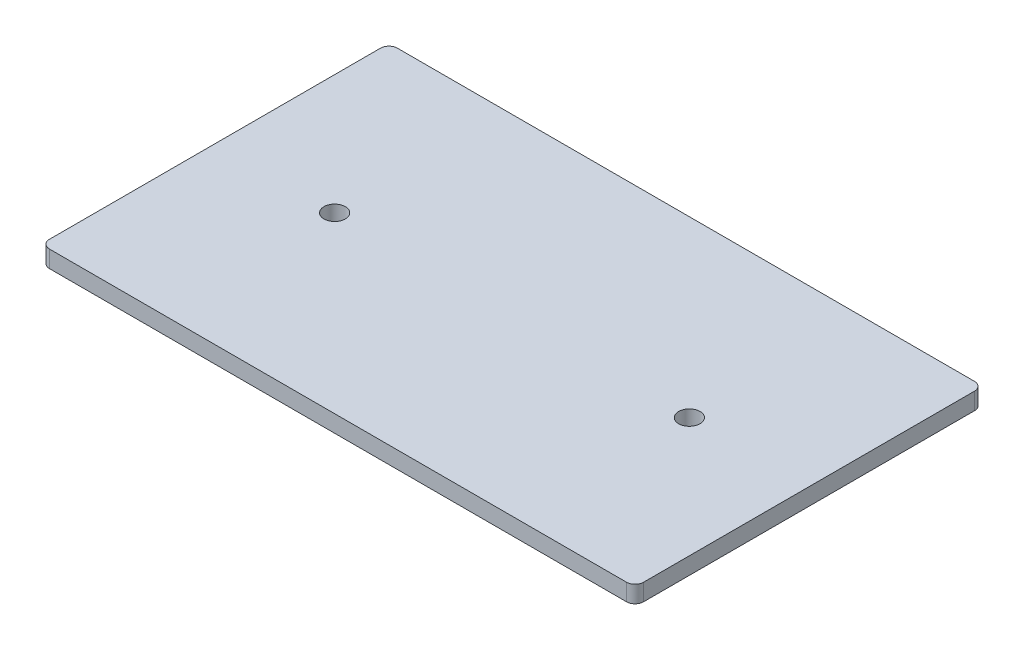
ISO-10303-21;
HEADER;
FILE_DESCRIPTION(('STEP AP214'),'2;1');
FILE_NAME('part.step','',(''),(''),'','','');
FILE_SCHEMA(('AUTOMOTIVE_DESIGN { 1 0 10303 214 1 1 1 1 }'));
ENDSEC;
DATA;
#1=APPLICATION_CONTEXT('core data for automotive mechanical design processes');
#2=APPLICATION_PROTOCOL_DEFINITION('international standard','automotive_design',2000,#1);
#3=PRODUCT_CONTEXT('',#1,'mechanical');
#4=PRODUCT('Part','Part','',(#3));
#5=PRODUCT_RELATED_PRODUCT_CATEGORY('part','',(#4));
#6=PRODUCT_DEFINITION_FORMATION('','',#4);
#7=PRODUCT_DEFINITION_CONTEXT('part definition',#1,'design');
#8=PRODUCT_DEFINITION('design','',#6,#7);
#9=PRODUCT_DEFINITION_SHAPE('','',#8);
#10=(LENGTH_UNIT() NAMED_UNIT(*) SI_UNIT(.MILLI.,.METRE.));
#11=(NAMED_UNIT(*) PLANE_ANGLE_UNIT() SI_UNIT($,.RADIAN.));
#12=(NAMED_UNIT(*) SI_UNIT($,.STERADIAN.) SOLID_ANGLE_UNIT());
#13=UNCERTAINTY_MEASURE_WITH_UNIT(LENGTH_MEASURE(1.E-05),#10,'distance_accuracy_value','');
#14=(GEOMETRIC_REPRESENTATION_CONTEXT(3) GLOBAL_UNCERTAINTY_ASSIGNED_CONTEXT((#13)) GLOBAL_UNIT_ASSIGNED_CONTEXT((#10,
#11,#12)) REPRESENTATION_CONTEXT('',''));
#15=CARTESIAN_POINT('',(0.,0.,0.));
#16=DIRECTION('',(0.,0.,1.));
#17=DIRECTION('',(1.,0.,0.));
#18=AXIS2_PLACEMENT_3D('',#15,#16,#17);
#19=CARTESIAN_POINT('',(-44.45,2.54,26.035));
#20=DIRECTION('',(1.,0.,0.));
#21=DIRECTION('',(0.,0.,-1.));
#22=AXIS2_PLACEMENT_3D('',#19,#20,#21);
#23=PLANE('',#22);
#24=DIRECTION('',(0.,0.,1.));
#25=VECTOR('',#24,1.);
#26=CARTESIAN_POINT('',(-44.45,2.54,26.035));
#27=LINE('',#26,#25);
#28=CARTESIAN_POINT('',(-44.45,2.54,-24.765));
#29=VERTEX_POINT('',#28);
#30=CARTESIAN_POINT('',(-44.45,2.54,24.765));
#31=VERTEX_POINT('',#30);
#32=EDGE_CURVE('E132',#29,#31,#27,.T.);
#33=ORIENTED_EDGE('',*,*,#32,.F.);
#34=DIRECTION('',(0.,-1.,0.));
#35=VECTOR('',#34,1.);
#36=CARTESIAN_POINT('',(-44.45,2.54,-24.765));
#37=LINE('',#36,#35);
#38=CARTESIAN_POINT('',(-44.45,0.,-24.765));
#39=VERTEX_POINT('',#38);
#40=EDGE_CURVE('E117',#29,#39,#37,.T.);
#41=ORIENTED_EDGE('',*,*,#40,.T.);
#42=DIRECTION('',(0.,0.,1.));
#43=VECTOR('',#42,1.);
#44=CARTESIAN_POINT('',(-44.45,0.,26.035));
#45=LINE('',#44,#43);
#46=CARTESIAN_POINT('',(-44.45,0.,24.765));
#47=VERTEX_POINT('',#46);
#48=EDGE_CURVE('E129',#39,#47,#45,.T.);
#49=ORIENTED_EDGE('',*,*,#48,.T.);
#50=DIRECTION('',(0.,-1.,0.));
#51=VECTOR('',#50,1.);
#52=CARTESIAN_POINT('',(-44.45,2.54,24.765));
#53=LINE('',#52,#51);
#54=EDGE_CURVE('E134',#47,#31,#53,.F.);
#55=ORIENTED_EDGE('',*,*,#54,.T.);
#56=EDGE_LOOP('',(#33,#41,#49,#55));
#57=FACE_BOUND('',#56,.T.);
#58=ADVANCED_FACE('F44',(#57),#23,.F.);
#59=CARTESIAN_POINT('',(44.45,2.54,26.035));
#60=DIRECTION('',(0.,0.,-1.));
#61=DIRECTION('',(-1.,0.,0.));
#62=AXIS2_PLACEMENT_3D('',#59,#60,#61);
#63=PLANE('',#62);
#64=DIRECTION('',(1.,0.,0.));
#65=VECTOR('',#64,1.);
#66=CARTESIAN_POINT('',(44.45,2.54,26.035));
#67=LINE('',#66,#65);
#68=CARTESIAN_POINT('',(-43.18,2.54,26.035));
#69=VERTEX_POINT('',#68);
#70=CARTESIAN_POINT('',(43.18,2.54,26.035));
#71=VERTEX_POINT('',#70);
#72=EDGE_CURVE('E184',#69,#71,#67,.T.);
#73=ORIENTED_EDGE('',*,*,#72,.F.);
#74=DIRECTION('',(0.,-1.,0.));
#75=VECTOR('',#74,1.);
#76=CARTESIAN_POINT('',(-43.18,2.54,26.035));
#77=LINE('',#76,#75);
#78=CARTESIAN_POINT('',(-43.18,0.,26.035));
#79=VERTEX_POINT('',#78);
#80=EDGE_CURVE('E11',#69,#79,#77,.T.);
#81=ORIENTED_EDGE('',*,*,#80,.T.);
#82=DIRECTION('',(1.,0.,0.));
#83=VECTOR('',#82,1.);
#84=CARTESIAN_POINT('',(44.45,0.,26.035));
#85=LINE('',#84,#83);
#86=CARTESIAN_POINT('',(43.18,0.,26.035));
#87=VERTEX_POINT('',#86);
#88=EDGE_CURVE('E139',#79,#87,#85,.T.);
#89=ORIENTED_EDGE('',*,*,#88,.T.);
#90=DIRECTION('',(0.,-1.,0.));
#91=VECTOR('',#90,1.);
#92=CARTESIAN_POINT('',(43.18,2.54,26.035));
#93=LINE('',#92,#91);
#94=EDGE_CURVE('E53',#87,#71,#93,.F.);
#95=ORIENTED_EDGE('',*,*,#94,.T.);
#96=EDGE_LOOP('',(#73,#81,#89,#95));
#97=FACE_BOUND('',#96,.T.);
#98=ADVANCED_FACE('F202',(#97),#63,.F.);
#99=CARTESIAN_POINT('',(44.45,2.54,26.035));
#100=DIRECTION('',(-1.,0.,0.));
#101=DIRECTION('',(0.,0.,1.));
#102=AXIS2_PLACEMENT_3D('',#99,#100,#101);
#103=PLANE('',#102);
#104=DIRECTION('',(0.,0.,-1.));
#105=VECTOR('',#104,1.);
#106=CARTESIAN_POINT('',(44.45,0.,26.035));
#107=LINE('',#106,#105);
#108=CARTESIAN_POINT('',(44.45,0.,24.765));
#109=VERTEX_POINT('',#108);
#110=CARTESIAN_POINT('',(44.45,0.,-24.765));
#111=VERTEX_POINT('',#110);
#112=EDGE_CURVE('E142',#109,#111,#107,.T.);
#113=ORIENTED_EDGE('',*,*,#112,.T.);
#114=DIRECTION('',(0.,-1.,0.));
#115=VECTOR('',#114,1.);
#116=CARTESIAN_POINT('',(44.45,2.54,-24.765));
#117=LINE('',#116,#115);
#118=CARTESIAN_POINT('',(44.45,2.54,-24.765));
#119=VERTEX_POINT('',#118);
#120=EDGE_CURVE('E61',#111,#119,#117,.F.);
#121=ORIENTED_EDGE('',*,*,#120,.T.);
#122=DIRECTION('',(0.,0.,-1.));
#123=VECTOR('',#122,1.);
#124=CARTESIAN_POINT('',(44.45,2.54,26.035));
#125=LINE('',#124,#123);
#126=CARTESIAN_POINT('',(44.45,2.54,24.765));
#127=VERTEX_POINT('',#126);
#128=EDGE_CURVE('E185',#127,#119,#125,.T.);
#129=ORIENTED_EDGE('',*,*,#128,.F.);
#130=DIRECTION('',(0.,-1.,0.));
#131=VECTOR('',#130,1.);
#132=CARTESIAN_POINT('',(44.45,2.54,24.765));
#133=LINE('',#132,#131);
#134=EDGE_CURVE('E167',#127,#109,#133,.T.);
#135=ORIENTED_EDGE('',*,*,#134,.T.);
#136=EDGE_LOOP('',(#113,#121,#129,#135));
#137=FACE_BOUND('',#136,.T.);
#138=ADVANCED_FACE('F196',(#137),#103,.F.);
#139=CARTESIAN_POINT('',(44.45,2.54,-26.035));
#140=DIRECTION('',(0.,0.,1.));
#141=DIRECTION('',(1.,0.,0.));
#142=AXIS2_PLACEMENT_3D('',#139,#140,#141);
#143=PLANE('',#142);
#144=DIRECTION('',(-1.,0.,0.));
#145=VECTOR('',#144,1.);
#146=CARTESIAN_POINT('',(44.45,0.,-26.035));
#147=LINE('',#146,#145);
#148=CARTESIAN_POINT('',(43.18,0.,-26.035));
#149=VERTEX_POINT('',#148);
#150=CARTESIAN_POINT('',(-43.18,0.,-26.035));
#151=VERTEX_POINT('',#150);
#152=EDGE_CURVE('E151',#149,#151,#147,.T.);
#153=ORIENTED_EDGE('',*,*,#152,.T.);
#154=DIRECTION('',(0.,-1.,0.));
#155=VECTOR('',#154,1.);
#156=CARTESIAN_POINT('',(-43.18,2.54,-26.035));
#157=LINE('',#156,#155);
#158=CARTESIAN_POINT('',(-43.18,2.54,-26.035));
#159=VERTEX_POINT('',#158);
#160=EDGE_CURVE('E118',#151,#159,#157,.F.);
#161=ORIENTED_EDGE('',*,*,#160,.T.);
#162=DIRECTION('',(-1.,0.,0.));
#163=VECTOR('',#162,1.);
#164=CARTESIAN_POINT('',(44.45,2.54,-26.035));
#165=LINE('',#164,#163);
#166=CARTESIAN_POINT('',(43.18,2.54,-26.035));
#167=VERTEX_POINT('',#166);
#168=EDGE_CURVE('E147',#167,#159,#165,.T.);
#169=ORIENTED_EDGE('',*,*,#168,.F.);
#170=DIRECTION('',(0.,-1.,0.));
#171=VECTOR('',#170,1.);
#172=CARTESIAN_POINT('',(43.18,2.54,-26.035));
#173=LINE('',#172,#171);
#174=EDGE_CURVE('E123',#167,#149,#173,.T.);
#175=ORIENTED_EDGE('',*,*,#174,.T.);
#176=EDGE_LOOP('',(#153,#161,#169,#175));
#177=FACE_BOUND('',#176,.T.);
#178=ADVANCED_FACE('F192',(#177),#143,.F.);
#179=CARTESIAN_POINT('',(0.,2.54,0.));
#180=DIRECTION('',(0.,1.,0.));
#181=DIRECTION('',(0.,0.,1.));
#182=AXIS2_PLACEMENT_3D('',#179,#180,#181);
#183=PLANE('',#182);
#184=CARTESIAN_POINT('',(-26.543,2.54,0.));
#185=DIRECTION('',(0.,1.,0.));
#186=DIRECTION('',(0.,0.,1.));
#187=AXIS2_PLACEMENT_3D('',#184,#185,#186);
#188=CIRCLE('',#187,1.6);
#189=CARTESIAN_POINT('',(-26.543,2.54,1.6));
#190=VERTEX_POINT('',#189);
#191=EDGE_CURVE('E172',#190,#190,#188,.T.);
#192=ORIENTED_EDGE('',*,*,#191,.F.);
#193=EDGE_LOOP('',(#192));
#194=FACE_BOUND('',#193,.T.);
#195=CARTESIAN_POINT('',(26.543,2.54,0.));
#196=DIRECTION('',(0.,1.,0.));
#197=DIRECTION('',(0.,0.,1.));
#198=AXIS2_PLACEMENT_3D('',#195,#196,#197);
#199=CIRCLE('',#198,1.6);
#200=CARTESIAN_POINT('',(26.543,2.54,1.6));
#201=VERTEX_POINT('',#200);
#202=EDGE_CURVE('E176',#201,#201,#199,.T.);
#203=ORIENTED_EDGE('',*,*,#202,.F.);
#204=EDGE_LOOP('',(#203));
#205=FACE_BOUND('',#204,.T.);
#206=ORIENTED_EDGE('',*,*,#168,.T.);
#207=CARTESIAN_POINT('',(-43.18,2.54,-24.765));
#208=DIRECTION('',(0.,1.,0.));
#209=DIRECTION('',(0.,0.,1.));
#210=AXIS2_PLACEMENT_3D('',#207,#208,#209);
#211=CIRCLE('',#210,1.27);
#212=EDGE_CURVE('E165',#159,#29,#211,.T.);
#213=ORIENTED_EDGE('',*,*,#212,.T.);
#214=ORIENTED_EDGE('',*,*,#32,.T.);
#215=CARTESIAN_POINT('',(-43.18,2.54,24.765));
#216=DIRECTION('',(0.,1.,0.));
#217=DIRECTION('',(0.,0.,1.));
#218=AXIS2_PLACEMENT_3D('',#215,#216,#217);
#219=CIRCLE('',#218,1.27);
#220=EDGE_CURVE('E161',#31,#69,#219,.T.);
#221=ORIENTED_EDGE('',*,*,#220,.T.);
#222=ORIENTED_EDGE('',*,*,#72,.T.);
#223=CARTESIAN_POINT('',(43.18,2.54,24.765));
#224=DIRECTION('',(0.,1.,0.));
#225=DIRECTION('',(0.,0.,1.));
#226=AXIS2_PLACEMENT_3D('',#223,#224,#225);
#227=CIRCLE('',#226,1.27);
#228=EDGE_CURVE('E68',#71,#127,#227,.T.);
#229=ORIENTED_EDGE('',*,*,#228,.T.);
#230=ORIENTED_EDGE('',*,*,#128,.T.);
#231=CARTESIAN_POINT('',(43.18,2.54,-24.765));
#232=DIRECTION('',(0.,1.,0.));
#233=DIRECTION('',(0.,0.,1.));
#234=AXIS2_PLACEMENT_3D('',#231,#232,#233);
#235=CIRCLE('',#234,1.27);
#236=EDGE_CURVE('E163',#119,#167,#235,.T.);
#237=ORIENTED_EDGE('',*,*,#236,.T.);
#238=EDGE_LOOP('',(#206,#213,#214,#221,#222,#229,#230,#237));
#239=FACE_BOUND('',#238,.T.);
#240=ADVANCED_FACE('F189',(#194,#205,#239),#183,.T.);
#241=CARTESIAN_POINT('',(0.,0.,0.));
#242=DIRECTION('',(0.,1.,0.));
#243=DIRECTION('',(0.,0.,1.));
#244=AXIS2_PLACEMENT_3D('',#241,#242,#243);
#245=PLANE('',#244);
#246=CARTESIAN_POINT('',(-26.543,0.,0.));
#247=DIRECTION('',(0.,1.,0.));
#248=DIRECTION('',(0.,0.,1.));
#249=AXIS2_PLACEMENT_3D('',#246,#247,#248);
#250=CIRCLE('',#249,1.6);
#251=CARTESIAN_POINT('',(-26.543,0.,1.6));
#252=VERTEX_POINT('',#251);
#253=EDGE_CURVE('E48',#252,#252,#250,.T.);
#254=ORIENTED_EDGE('',*,*,#253,.T.);
#255=EDGE_LOOP('',(#254));
#256=FACE_BOUND('',#255,.T.);
#257=CARTESIAN_POINT('',(26.543,0.,0.));
#258=DIRECTION('',(0.,1.,0.));
#259=DIRECTION('',(0.,0.,1.));
#260=AXIS2_PLACEMENT_3D('',#257,#258,#259);
#261=CIRCLE('',#260,1.6);
#262=CARTESIAN_POINT('',(26.543,0.,1.6));
#263=VERTEX_POINT('',#262);
#264=EDGE_CURVE('E145',#263,#263,#261,.T.);
#265=ORIENTED_EDGE('',*,*,#264,.T.);
#266=EDGE_LOOP('',(#265));
#267=FACE_BOUND('',#266,.T.);
#268=ORIENTED_EDGE('',*,*,#48,.F.);
#269=CARTESIAN_POINT('',(-43.18,0.,-24.765));
#270=DIRECTION('',(0.,1.,0.));
#271=DIRECTION('',(0.,0.,1.));
#272=AXIS2_PLACEMENT_3D('',#269,#270,#271);
#273=CIRCLE('',#272,1.27);
#274=EDGE_CURVE('E113',#39,#151,#273,.F.);
#275=ORIENTED_EDGE('',*,*,#274,.T.);
#276=ORIENTED_EDGE('',*,*,#152,.F.);
#277=CARTESIAN_POINT('',(43.18,0.,-24.765));
#278=DIRECTION('',(0.,1.,0.));
#279=DIRECTION('',(0.,0.,1.));
#280=AXIS2_PLACEMENT_3D('',#277,#278,#279);
#281=CIRCLE('',#280,1.27);
#282=EDGE_CURVE('E124',#149,#111,#281,.F.);
#283=ORIENTED_EDGE('',*,*,#282,.T.);
#284=ORIENTED_EDGE('',*,*,#112,.F.);
#285=CARTESIAN_POINT('',(43.18,0.,24.765));
#286=DIRECTION('',(0.,1.,0.));
#287=DIRECTION('',(0.,0.,1.));
#288=AXIS2_PLACEMENT_3D('',#285,#286,#287);
#289=CIRCLE('',#288,1.27);
#290=EDGE_CURVE('E133',#109,#87,#289,.F.);
#291=ORIENTED_EDGE('',*,*,#290,.T.);
#292=ORIENTED_EDGE('',*,*,#88,.F.);
#293=CARTESIAN_POINT('',(-43.18,0.,24.765));
#294=DIRECTION('',(0.,1.,0.));
#295=DIRECTION('',(0.,0.,1.));
#296=AXIS2_PLACEMENT_3D('',#293,#294,#295);
#297=CIRCLE('',#296,1.27);
#298=EDGE_CURVE('E138',#79,#47,#297,.F.);
#299=ORIENTED_EDGE('',*,*,#298,.T.);
#300=EDGE_LOOP('',(#268,#275,#276,#283,#284,#291,#292,#299));
#301=FACE_BOUND('',#300,.T.);
#302=ADVANCED_FACE('F136',(#256,#267,#301),#245,.F.);
#303=CARTESIAN_POINT('',(-43.18,2.54,-24.765));
#304=DIRECTION('',(0.,-1.,0.));
#305=DIRECTION('',(0.,0.,-1.));
#306=AXIS2_PLACEMENT_3D('',#303,#304,#305);
#307=CYLINDRICAL_SURFACE('',#306,1.27);
#308=ORIENTED_EDGE('',*,*,#212,.F.);
#309=ORIENTED_EDGE('',*,*,#160,.F.);
#310=ORIENTED_EDGE('',*,*,#274,.F.);
#311=ORIENTED_EDGE('',*,*,#40,.F.);
#312=EDGE_LOOP('',(#308,#309,#310,#311));
#313=FACE_BOUND('',#312,.T.);
#314=ADVANCED_FACE('F116',(#313),#307,.T.);
#315=CARTESIAN_POINT('',(43.18,2.54,-24.765));
#316=DIRECTION('',(0.,-1.,0.));
#317=DIRECTION('',(0.,0.,-1.));
#318=AXIS2_PLACEMENT_3D('',#315,#316,#317);
#319=CYLINDRICAL_SURFACE('',#318,1.27);
#320=ORIENTED_EDGE('',*,*,#236,.F.);
#321=ORIENTED_EDGE('',*,*,#120,.F.);
#322=ORIENTED_EDGE('',*,*,#282,.F.);
#323=ORIENTED_EDGE('',*,*,#174,.F.);
#324=EDGE_LOOP('',(#320,#321,#322,#323));
#325=FACE_BOUND('',#324,.T.);
#326=ADVANCED_FACE('F194',(#325),#319,.T.);
#327=CARTESIAN_POINT('',(-43.18,2.54,24.765));
#328=DIRECTION('',(0.,-1.,0.));
#329=DIRECTION('',(0.,0.,-1.));
#330=AXIS2_PLACEMENT_3D('',#327,#328,#329);
#331=CYLINDRICAL_SURFACE('',#330,1.27);
#332=ORIENTED_EDGE('',*,*,#220,.F.);
#333=ORIENTED_EDGE('',*,*,#54,.F.);
#334=ORIENTED_EDGE('',*,*,#298,.F.);
#335=ORIENTED_EDGE('',*,*,#80,.F.);
#336=EDGE_LOOP('',(#332,#333,#334,#335));
#337=FACE_BOUND('',#336,.T.);
#338=ADVANCED_FACE('F206',(#337),#331,.T.);
#339=CARTESIAN_POINT('',(43.18,2.54,24.765));
#340=DIRECTION('',(0.,-1.,0.));
#341=DIRECTION('',(0.,0.,-1.));
#342=AXIS2_PLACEMENT_3D('',#339,#340,#341);
#343=CYLINDRICAL_SURFACE('',#342,1.27);
#344=ORIENTED_EDGE('',*,*,#228,.F.);
#345=ORIENTED_EDGE('',*,*,#94,.F.);
#346=ORIENTED_EDGE('',*,*,#290,.F.);
#347=ORIENTED_EDGE('',*,*,#134,.F.);
#348=EDGE_LOOP('',(#344,#345,#346,#347));
#349=FACE_BOUND('',#348,.T.);
#350=ADVANCED_FACE('F46',(#349),#343,.T.);
#351=CARTESIAN_POINT('',(26.543,-5.08,0.));
#352=DIRECTION('',(0.,1.,0.));
#353=DIRECTION('',(0.,0.,1.));
#354=AXIS2_PLACEMENT_3D('',#351,#352,#353);
#355=CYLINDRICAL_SURFACE('',#354,1.6);
#356=ORIENTED_EDGE('',*,*,#202,.T.);
#357=EDGE_LOOP('',(#356));
#358=FACE_BOUND('',#357,.T.);
#359=ORIENTED_EDGE('',*,*,#264,.F.);
#360=EDGE_LOOP('',(#359));
#361=FACE_BOUND('',#360,.T.);
#362=ADVANCED_FACE('F212',(#358,#361),#355,.F.);
#363=CARTESIAN_POINT('',(-26.543,-5.08,0.));
#364=DIRECTION('',(0.,1.,0.));
#365=DIRECTION('',(0.,0.,1.));
#366=AXIS2_PLACEMENT_3D('',#363,#364,#365);
#367=CYLINDRICAL_SURFACE('',#366,1.6);
#368=ORIENTED_EDGE('',*,*,#191,.T.);
#369=EDGE_LOOP('',(#368));
#370=FACE_BOUND('',#369,.T.);
#371=ORIENTED_EDGE('',*,*,#253,.F.);
#372=EDGE_LOOP('',(#371));
#373=FACE_BOUND('',#372,.T.);
#374=ADVANCED_FACE('F286',(#370,#373),#367,.F.);
#375=CLOSED_SHELL('',(#58,#98,#138,#178,#240,#302,#314,#326,#338,#350,#362,#374));
#376=MANIFOLD_SOLID_BREP('B2',#375);
#377=ADVANCED_BREP_SHAPE_REPRESENTATION('',(#18,#376),#14);
#378=SHAPE_DEFINITION_REPRESENTATION(#9,#377);
ENDSEC;
END-ISO-10303-21;
